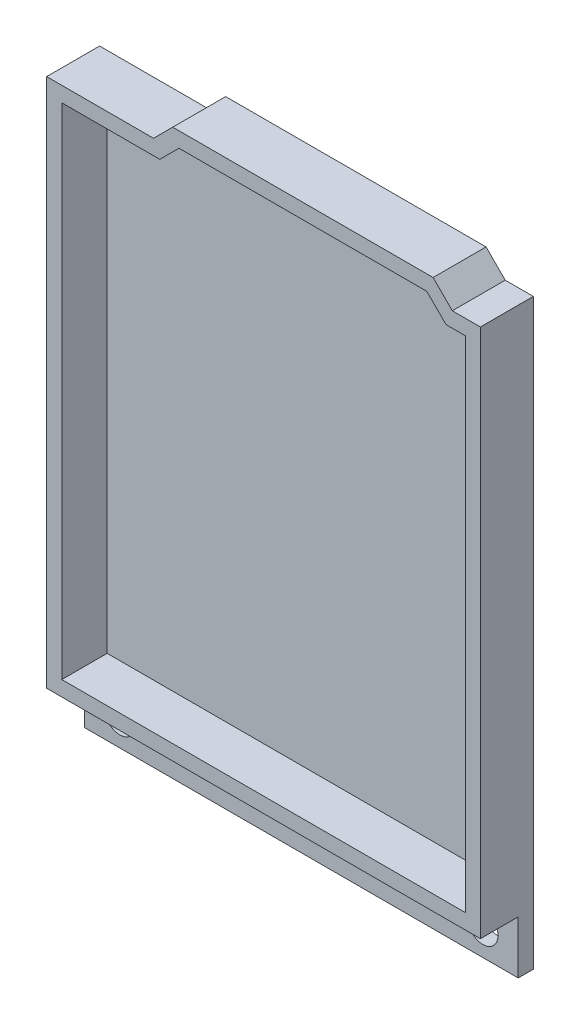
ISO-10303-21;
HEADER;
FILE_DESCRIPTION(('STEP AP214'),'2;1');
FILE_NAME('part.step','',(''),(''),'','','');
FILE_SCHEMA(('AUTOMOTIVE_DESIGN { 1 0 10303 214 1 1 1 1 }'));
ENDSEC;
DATA;
#1=APPLICATION_CONTEXT('core data for automotive mechanical design processes');
#2=APPLICATION_PROTOCOL_DEFINITION('international standard','automotive_design',2000,#1);
#3=PRODUCT_CONTEXT('',#1,'mechanical');
#4=PRODUCT('Part','Part','',(#3));
#5=PRODUCT_RELATED_PRODUCT_CATEGORY('part','',(#4));
#6=PRODUCT_DEFINITION_FORMATION('','',#4);
#7=PRODUCT_DEFINITION_CONTEXT('part definition',#1,'design');
#8=PRODUCT_DEFINITION('design','',#6,#7);
#9=PRODUCT_DEFINITION_SHAPE('','',#8);
#10=(LENGTH_UNIT() NAMED_UNIT(*) SI_UNIT(.MILLI.,.METRE.));
#11=(NAMED_UNIT(*) PLANE_ANGLE_UNIT() SI_UNIT($,.RADIAN.));
#12=(NAMED_UNIT(*) SI_UNIT($,.STERADIAN.) SOLID_ANGLE_UNIT());
#13=UNCERTAINTY_MEASURE_WITH_UNIT(LENGTH_MEASURE(1.E-05),#10,'distance_accuracy_value','');
#14=(GEOMETRIC_REPRESENTATION_CONTEXT(3) GLOBAL_UNCERTAINTY_ASSIGNED_CONTEXT((#13)) GLOBAL_UNIT_ASSIGNED_CONTEXT((#10,
#11,#12)) REPRESENTATION_CONTEXT('',''));
#15=CARTESIAN_POINT('',(0.,0.,0.));
#16=DIRECTION('',(0.,0.,1.));
#17=DIRECTION('',(1.,0.,0.));
#18=AXIS2_PLACEMENT_3D('',#15,#16,#17);
#19=CARTESIAN_POINT('',(2.,-2.,-7.));
#20=DIRECTION('',(0.,-1.,0.));
#21=DIRECTION('',(0.,0.,-1.));
#22=AXIS2_PLACEMENT_3D('',#19,#20,#21);
#23=PLANE('',#22);
#24=DIRECTION('',(0.,0.,1.));
#25=VECTOR('',#24,1.);
#26=CARTESIAN_POINT('',(-55.34,-2.,-7.));
#27=LINE('',#26,#25);
#28=CARTESIAN_POINT('',(-55.34,-2.,-5.));
#29=VERTEX_POINT('',#28);
#30=CARTESIAN_POINT('',(-55.34,-2.,0.));
#31=VERTEX_POINT('',#30);
#32=EDGE_CURVE('E41',#29,#31,#27,.T.);
#33=ORIENTED_EDGE('',*,*,#32,.F.);
#34=DIRECTION('',(1.,0.,0.));
#35=VECTOR('',#34,1.);
#36=CARTESIAN_POINT('',(-55.34,-2.,-5.));
#37=LINE('',#36,#35);
#38=CARTESIAN_POINT('',(2.,-2.,-5.));
#39=VERTEX_POINT('',#38);
#40=EDGE_CURVE('E157',#29,#39,#37,.T.);
#41=ORIENTED_EDGE('',*,*,#40,.T.);
#42=DIRECTION('',(0.,0.,1.));
#43=VECTOR('',#42,1.);
#44=CARTESIAN_POINT('',(2.,-2.,-7.));
#45=LINE('',#44,#43);
#46=CARTESIAN_POINT('',(2.,-2.,0.));
#47=VERTEX_POINT('',#46);
#48=EDGE_CURVE('E11',#39,#47,#45,.T.);
#49=ORIENTED_EDGE('',*,*,#48,.T.);
#50=DIRECTION('',(1.,0.,0.));
#51=VECTOR('',#50,1.);
#52=CARTESIAN_POINT('',(2.,-2.,0.));
#53=LINE('',#52,#51);
#54=EDGE_CURVE('E175',#31,#47,#53,.T.);
#55=ORIENTED_EDGE('',*,*,#54,.F.);
#56=EDGE_LOOP('',(#33,#41,#49,#55));
#57=FACE_BOUND('',#56,.T.);
#58=ADVANCED_FACE('F32',(#57),#23,.T.);
#59=CARTESIAN_POINT('',(2.,68.04,-7.));
#60=DIRECTION('',(1.,0.,0.));
#61=DIRECTION('',(0.,0.,-1.));
#62=AXIS2_PLACEMENT_3D('',#59,#60,#61);
#63=PLANE('',#62);
#64=DIRECTION('',(0.,1.,0.));
#65=VECTOR('',#64,1.);
#66=CARTESIAN_POINT('',(2.,68.04,0.));
#67=LINE('',#66,#65);
#68=CARTESIAN_POINT('',(2.,68.04,0.));
#69=VERTEX_POINT('',#68);
#70=EDGE_CURVE('E210',#47,#69,#67,.T.);
#71=ORIENTED_EDGE('',*,*,#70,.F.);
#72=ORIENTED_EDGE('',*,*,#48,.F.);
#73=DIRECTION('',(0.,-1.,0.));
#74=VECTOR('',#73,1.);
#75=CARTESIAN_POINT('',(2.,-2.00000000000001,-5.));
#76=LINE('',#75,#74);
#77=CARTESIAN_POINT('',(2.,-9.00000000000001,-5.));
#78=VERTEX_POINT('',#77);
#79=EDGE_CURVE('E49',#39,#78,#76,.T.);
#80=ORIENTED_EDGE('',*,*,#79,.T.);
#81=DIRECTION('',(0.,0.,-1.));
#82=VECTOR('',#81,1.);
#83=CARTESIAN_POINT('',(2.,-9.00000000000001,-5.));
#84=LINE('',#83,#82);
#85=CARTESIAN_POINT('',(2.,-9.00000000000001,-7.));
#86=VERTEX_POINT('',#85);
#87=EDGE_CURVE('E264',#78,#86,#84,.T.);
#88=ORIENTED_EDGE('',*,*,#87,.T.);
#89=DIRECTION('',(0.,1.,0.));
#90=VECTOR('',#89,1.);
#91=CARTESIAN_POINT('',(2.,68.04,-7.));
#92=LINE('',#91,#90);
#93=CARTESIAN_POINT('',(2.,68.04,-7.));
#94=VERTEX_POINT('',#93);
#95=EDGE_CURVE('E230',#86,#94,#92,.T.);
#96=ORIENTED_EDGE('',*,*,#95,.T.);
#97=DIRECTION('',(0.,0.,1.));
#98=VECTOR('',#97,1.);
#99=CARTESIAN_POINT('',(2.,68.04,-7.));
#100=LINE('',#99,#98);
#101=EDGE_CURVE('E182',#94,#69,#100,.T.);
#102=ORIENTED_EDGE('',*,*,#101,.T.);
#103=EDGE_LOOP('',(#71,#72,#80,#88,#96,#102));
#104=FACE_BOUND('',#103,.T.);
#105=ADVANCED_FACE('F34',(#104),#63,.T.);
#106=CARTESIAN_POINT('',(-55.34,-2.,-7.));
#107=DIRECTION('',(-1.,0.,0.));
#108=DIRECTION('',(0.,0.,1.));
#109=AXIS2_PLACEMENT_3D('',#106,#107,#108);
#110=PLANE('',#109);
#111=DIRECTION('',(0.,-1.,0.));
#112=VECTOR('',#111,1.);
#113=CARTESIAN_POINT('',(-55.34,-2.,0.));
#114=LINE('',#113,#112);
#115=CARTESIAN_POINT('',(-55.34,68.04,0.));
#116=VERTEX_POINT('',#115);
#117=EDGE_CURVE('E229',#116,#31,#114,.T.);
#118=ORIENTED_EDGE('',*,*,#117,.F.);
#119=DIRECTION('',(0.,0.,1.));
#120=VECTOR('',#119,1.);
#121=CARTESIAN_POINT('',(-55.34,68.04,-7.));
#122=LINE('',#121,#120);
#123=CARTESIAN_POINT('',(-55.34,68.04,-7.));
#124=VERTEX_POINT('',#123);
#125=EDGE_CURVE('E176',#124,#116,#122,.T.);
#126=ORIENTED_EDGE('',*,*,#125,.F.);
#127=DIRECTION('',(0.,-1.,0.));
#128=VECTOR('',#127,1.);
#129=CARTESIAN_POINT('',(-55.34,-2.,-7.));
#130=LINE('',#129,#128);
#131=CARTESIAN_POINT('',(-55.34,-9.,-7.));
#132=VERTEX_POINT('',#131);
#133=EDGE_CURVE('E198',#124,#132,#130,.T.);
#134=ORIENTED_EDGE('',*,*,#133,.T.);
#135=DIRECTION('',(0.,0.,-1.));
#136=VECTOR('',#135,1.);
#137=CARTESIAN_POINT('',(-55.34,-9.,-5.));
#138=LINE('',#137,#136);
#139=CARTESIAN_POINT('',(-55.34,-9.,-5.));
#140=VERTEX_POINT('',#139);
#141=EDGE_CURVE('E171',#140,#132,#138,.T.);
#142=ORIENTED_EDGE('',*,*,#141,.F.);
#143=DIRECTION('',(0.,1.,0.));
#144=VECTOR('',#143,1.);
#145=CARTESIAN_POINT('',(-55.34,-2.,-5.));
#146=LINE('',#145,#144);
#147=EDGE_CURVE('E160',#140,#29,#146,.T.);
#148=ORIENTED_EDGE('',*,*,#147,.T.);
#149=ORIENTED_EDGE('',*,*,#32,.T.);
#150=EDGE_LOOP('',(#118,#126,#134,#142,#148,#149));
#151=FACE_BOUND('',#150,.T.);
#152=ADVANCED_FACE('F168',(#151),#110,.T.);
#153=CARTESIAN_POINT('',(-55.34,68.04,-7.));
#154=DIRECTION('',(0.,1.,0.));
#155=DIRECTION('',(0.,0.,1.));
#156=AXIS2_PLACEMENT_3D('',#153,#154,#155);
#157=PLANE('',#156);
#158=DIRECTION('',(-1.,0.,0.));
#159=VECTOR('',#158,1.);
#160=CARTESIAN_POINT('',(-55.34,68.04,0.));
#161=LINE('',#160,#159);
#162=CARTESIAN_POINT('',(-41.2144271247462,68.04,0.));
#163=VERTEX_POINT('',#162);
#164=EDGE_CURVE('E226',#163,#116,#161,.T.);
#165=ORIENTED_EDGE('',*,*,#164,.F.);
#166=DIRECTION('',(0.,0.,1.));
#167=VECTOR('',#166,1.);
#168=CARTESIAN_POINT('',(-41.2144271247462,68.04,-7.));
#169=LINE('',#168,#167);
#170=CARTESIAN_POINT('',(-41.2144271247462,68.04,-7.));
#171=VERTEX_POINT('',#170);
#172=EDGE_CURVE('E178',#171,#163,#169,.T.);
#173=ORIENTED_EDGE('',*,*,#172,.F.);
#174=DIRECTION('',(-1.,0.,0.));
#175=VECTOR('',#174,1.);
#176=CARTESIAN_POINT('',(-55.34,68.04,-7.));
#177=LINE('',#176,#175);
#178=EDGE_CURVE('E202',#171,#124,#177,.T.);
#179=ORIENTED_EDGE('',*,*,#178,.T.);
#180=ORIENTED_EDGE('',*,*,#125,.T.);
#181=EDGE_LOOP('',(#165,#173,#179,#180));
#182=FACE_BOUND('',#181,.T.);
#183=ADVANCED_FACE('F388',(#182),#157,.T.);
#184=CARTESIAN_POINT('',(-41.2144271247462,68.04,-7.));
#185=DIRECTION('',(-0.707106781186547,0.707106781186547,0.));
#186=DIRECTION('',(-0.707106781186548,-0.707106781186548,0.));
#187=AXIS2_PLACEMENT_3D('',#184,#185,#186);
#188=PLANE('',#187);
#189=DIRECTION('',(-0.707106781186548,-0.707106781186548,0.));
#190=VECTOR('',#189,1.);
#191=CARTESIAN_POINT('',(-41.2144271247462,68.04,0.));
#192=LINE('',#191,#190);
#193=CARTESIAN_POINT('',(-38.6744271247462,70.58,0.));
#194=VERTEX_POINT('',#193);
#195=EDGE_CURVE('E223',#194,#163,#192,.T.);
#196=ORIENTED_EDGE('',*,*,#195,.F.);
#197=DIRECTION('',(0.,0.,1.));
#198=VECTOR('',#197,1.);
#199=CARTESIAN_POINT('',(-38.6744271247462,70.58,-7.));
#200=LINE('',#199,#198);
#201=CARTESIAN_POINT('',(-38.6744271247462,70.58,-7.));
#202=VERTEX_POINT('',#201);
#203=EDGE_CURVE('E190',#202,#194,#200,.T.);
#204=ORIENTED_EDGE('',*,*,#203,.F.);
#205=DIRECTION('',(-0.707106781186548,-0.707106781186548,0.));
#206=VECTOR('',#205,1.);
#207=CARTESIAN_POINT('',(-41.2144271247462,68.04,-7.));
#208=LINE('',#207,#206);
#209=EDGE_CURVE('E206',#202,#171,#208,.T.);
#210=ORIENTED_EDGE('',*,*,#209,.T.);
#211=ORIENTED_EDGE('',*,*,#172,.T.);
#212=EDGE_LOOP('',(#196,#204,#210,#211));
#213=FACE_BOUND('',#212,.T.);
#214=ADVANCED_FACE('F249',(#213),#188,.T.);
#215=CARTESIAN_POINT('',(-38.6744271247462,70.58,-7.));
#216=DIRECTION('',(0.,1.,0.));
#217=DIRECTION('',(0.,0.,1.));
#218=AXIS2_PLACEMENT_3D('',#215,#216,#217);
#219=PLANE('',#218);
#220=DIRECTION('',(-1.,0.,0.));
#221=VECTOR('',#220,1.);
#222=CARTESIAN_POINT('',(-38.6744271247462,70.58,0.));
#223=LINE('',#222,#221);
#224=CARTESIAN_POINT('',(-4.25157287525382,70.58,0.));
#225=VERTEX_POINT('',#224);
#226=EDGE_CURVE('E220',#225,#194,#223,.T.);
#227=ORIENTED_EDGE('',*,*,#226,.F.);
#228=DIRECTION('',(0.,0.,1.));
#229=VECTOR('',#228,1.);
#230=CARTESIAN_POINT('',(-4.25157287525382,70.58,-7.));
#231=LINE('',#230,#229);
#232=CARTESIAN_POINT('',(-4.25157287525382,70.58,-7.));
#233=VERTEX_POINT('',#232);
#234=EDGE_CURVE('E192',#233,#225,#231,.T.);
#235=ORIENTED_EDGE('',*,*,#234,.F.);
#236=DIRECTION('',(-1.,0.,0.));
#237=VECTOR('',#236,1.);
#238=CARTESIAN_POINT('',(-38.6744271247462,70.58,-7.));
#239=LINE('',#238,#237);
#240=EDGE_CURVE('E243',#233,#202,#239,.T.);
#241=ORIENTED_EDGE('',*,*,#240,.T.);
#242=ORIENTED_EDGE('',*,*,#203,.T.);
#243=EDGE_LOOP('',(#227,#235,#241,#242));
#244=FACE_BOUND('',#243,.T.);
#245=ADVANCED_FACE('F258',(#244),#219,.T.);
#246=CARTESIAN_POINT('',(-4.25157287525382,70.58,-7.));
#247=DIRECTION('',(0.707106781186547,0.707106781186547,0.));
#248=DIRECTION('',(-0.707106781186548,0.707106781186548,0.));
#249=AXIS2_PLACEMENT_3D('',#246,#247,#248);
#250=PLANE('',#249);
#251=DIRECTION('',(-0.707106781186548,0.707106781186548,0.));
#252=VECTOR('',#251,1.);
#253=CARTESIAN_POINT('',(-4.25157287525382,70.58,0.));
#254=LINE('',#253,#252);
#255=CARTESIAN_POINT('',(-1.71157287525382,68.04,0.));
#256=VERTEX_POINT('',#255);
#257=EDGE_CURVE('E217',#256,#225,#254,.T.);
#258=ORIENTED_EDGE('',*,*,#257,.F.);
#259=DIRECTION('',(0.,0.,1.));
#260=VECTOR('',#259,1.);
#261=CARTESIAN_POINT('',(-1.71157287525382,68.04,-7.));
#262=LINE('',#261,#260);
#263=CARTESIAN_POINT('',(-1.71157287525382,68.04,-7.));
#264=VERTEX_POINT('',#263);
#265=EDGE_CURVE('E193',#264,#256,#262,.T.);
#266=ORIENTED_EDGE('',*,*,#265,.F.);
#267=DIRECTION('',(-0.707106781186548,0.707106781186548,0.));
#268=VECTOR('',#267,1.);
#269=CARTESIAN_POINT('',(-4.25157287525382,70.58,-7.));
#270=LINE('',#269,#268);
#271=EDGE_CURVE('E235',#264,#233,#270,.T.);
#272=ORIENTED_EDGE('',*,*,#271,.T.);
#273=ORIENTED_EDGE('',*,*,#234,.T.);
#274=EDGE_LOOP('',(#258,#266,#272,#273));
#275=FACE_BOUND('',#274,.T.);
#276=ADVANCED_FACE('F260',(#275),#250,.T.);
#277=CARTESIAN_POINT('',(-1.71157287525382,68.04,-7.));
#278=DIRECTION('',(0.,1.,0.));
#279=DIRECTION('',(0.,0.,1.));
#280=AXIS2_PLACEMENT_3D('',#277,#278,#279);
#281=PLANE('',#280);
#282=DIRECTION('',(-1.,0.,0.));
#283=VECTOR('',#282,1.);
#284=CARTESIAN_POINT('',(-1.71157287525382,68.04,0.));
#285=LINE('',#284,#283);
#286=EDGE_CURVE('E213',#69,#256,#285,.T.);
#287=ORIENTED_EDGE('',*,*,#286,.F.);
#288=ORIENTED_EDGE('',*,*,#101,.F.);
#289=DIRECTION('',(-1.,0.,0.));
#290=VECTOR('',#289,1.);
#291=CARTESIAN_POINT('',(-1.71157287525382,68.04,-7.));
#292=LINE('',#291,#290);
#293=EDGE_CURVE('E232',#94,#264,#292,.T.);
#294=ORIENTED_EDGE('',*,*,#293,.T.);
#295=ORIENTED_EDGE('',*,*,#265,.T.);
#296=EDGE_LOOP('',(#287,#288,#294,#295));
#297=FACE_BOUND('',#296,.T.);
#298=ADVANCED_FACE('F262',(#297),#281,.T.);
#299=CARTESIAN_POINT('',(0.,0.,-7.));
#300=DIRECTION('',(0.,0.,-1.));
#301=DIRECTION('',(-1.,0.,0.));
#302=AXIS2_PLACEMENT_3D('',#299,#300,#301);
#303=PLANE('',#302);
#304=CARTESIAN_POINT('',(-50.67,-5.50000000000001,-7.));
#305=DIRECTION('',(0.,0.,1.));
#306=DIRECTION('',(1.,0.,0.));
#307=AXIS2_PLACEMENT_3D('',#304,#305,#306);
#308=CIRCLE('',#307,2.);
#309=CARTESIAN_POINT('',(-48.67,-5.50000000000001,-7.));
#310=VERTEX_POINT('',#309);
#311=EDGE_CURVE('E576',#310,#310,#308,.T.);
#312=ORIENTED_EDGE('',*,*,#311,.T.);
#313=EDGE_LOOP('',(#312));
#314=FACE_BOUND('',#313,.T.);
#315=CARTESIAN_POINT('',(-2.67,-5.50000000000001,-7.));
#316=DIRECTION('',(0.,0.,1.));
#317=DIRECTION('',(1.,0.,0.));
#318=AXIS2_PLACEMENT_3D('',#315,#316,#317);
#319=CIRCLE('',#318,2.);
#320=CARTESIAN_POINT('',(-0.670000000000002,-5.50000000000001,-7.));
#321=VERTEX_POINT('',#320);
#322=EDGE_CURVE('E277',#321,#321,#319,.T.);
#323=ORIENTED_EDGE('',*,*,#322,.T.);
#324=EDGE_LOOP('',(#323));
#325=FACE_BOUND('',#324,.T.);
#326=ORIENTED_EDGE('',*,*,#95,.F.);
#327=DIRECTION('',(-1.,0.,0.));
#328=VECTOR('',#327,1.);
#329=CARTESIAN_POINT('',(-55.34,-9.,-7.));
#330=LINE('',#329,#328);
#331=EDGE_CURVE('E172',#86,#132,#330,.T.);
#332=ORIENTED_EDGE('',*,*,#331,.T.);
#333=ORIENTED_EDGE('',*,*,#133,.F.);
#334=ORIENTED_EDGE('',*,*,#178,.F.);
#335=ORIENTED_EDGE('',*,*,#209,.F.);
#336=ORIENTED_EDGE('',*,*,#240,.F.);
#337=ORIENTED_EDGE('',*,*,#271,.F.);
#338=ORIENTED_EDGE('',*,*,#293,.F.);
#339=EDGE_LOOP('',(#326,#332,#333,#334,#335,#336,#337,#338));
#340=FACE_BOUND('',#339,.T.);
#341=ADVANCED_FACE('F254',(#314,#325,#340),#303,.T.);
#342=CARTESIAN_POINT('',(0.,0.,0.));
#343=DIRECTION('',(0.,0.,-1.));
#344=DIRECTION('',(-1.,0.,0.));
#345=AXIS2_PLACEMENT_3D('',#342,#343,#344);
#346=PLANE('',#345);
#347=DIRECTION('',(0.,1.,0.));
#348=VECTOR('',#347,1.);
#349=CARTESIAN_POINT('',(0.,66.04,0.));
#350=LINE('',#349,#348);
#351=CARTESIAN_POINT('',(0.,0.,0.));
#352=VERTEX_POINT('',#351);
#353=CARTESIAN_POINT('',(0.,66.04,0.));
#354=VERTEX_POINT('',#353);
#355=EDGE_CURVE('E303',#352,#354,#350,.T.);
#356=ORIENTED_EDGE('',*,*,#355,.F.);
#357=DIRECTION('',(1.,0.,0.));
#358=VECTOR('',#357,1.);
#359=CARTESIAN_POINT('',(0.,0.,0.));
#360=LINE('',#359,#358);
#361=CARTESIAN_POINT('',(-53.34,0.,0.));
#362=VERTEX_POINT('',#361);
#363=EDGE_CURVE('E300',#362,#352,#360,.T.);
#364=ORIENTED_EDGE('',*,*,#363,.F.);
#365=DIRECTION('',(0.,-1.,0.));
#366=VECTOR('',#365,1.);
#367=CARTESIAN_POINT('',(-53.34,0.,0.));
#368=LINE('',#367,#366);
#369=CARTESIAN_POINT('',(-53.34,66.04,0.));
#370=VERTEX_POINT('',#369);
#371=EDGE_CURVE('E321',#370,#362,#368,.T.);
#372=ORIENTED_EDGE('',*,*,#371,.F.);
#373=DIRECTION('',(-1.,0.,0.));
#374=VECTOR('',#373,1.);
#375=CARTESIAN_POINT('',(-53.34,66.04,0.));
#376=LINE('',#375,#374);
#377=CARTESIAN_POINT('',(-40.386,66.04,0.));
#378=VERTEX_POINT('',#377);
#379=EDGE_CURVE('E318',#378,#370,#376,.T.);
#380=ORIENTED_EDGE('',*,*,#379,.F.);
#381=DIRECTION('',(-0.707106781186548,-0.707106781186548,0.));
#382=VECTOR('',#381,1.);
#383=CARTESIAN_POINT('',(-40.386,66.04,0.));
#384=LINE('',#383,#382);
#385=CARTESIAN_POINT('',(-37.846,68.58,0.));
#386=VERTEX_POINT('',#385);
#387=EDGE_CURVE('E315',#386,#378,#384,.T.);
#388=ORIENTED_EDGE('',*,*,#387,.F.);
#389=DIRECTION('',(-1.,0.,0.));
#390=VECTOR('',#389,1.);
#391=CARTESIAN_POINT('',(-37.846,68.58,0.));
#392=LINE('',#391,#390);
#393=CARTESIAN_POINT('',(-5.08,68.58,0.));
#394=VERTEX_POINT('',#393);
#395=EDGE_CURVE('E312',#394,#386,#392,.T.);
#396=ORIENTED_EDGE('',*,*,#395,.F.);
#397=DIRECTION('',(-0.707106781186547,0.707106781186548,0.));
#398=VECTOR('',#397,1.);
#399=CARTESIAN_POINT('',(-5.08,68.58,0.));
#400=LINE('',#399,#398);
#401=CARTESIAN_POINT('',(-2.54,66.04,0.));
#402=VERTEX_POINT('',#401);
#403=EDGE_CURVE('E309',#402,#394,#400,.T.);
#404=ORIENTED_EDGE('',*,*,#403,.F.);
#405=DIRECTION('',(-1.,0.,0.));
#406=VECTOR('',#405,1.);
#407=CARTESIAN_POINT('',(-2.54,66.04,0.));
#408=LINE('',#407,#406);
#409=EDGE_CURVE('E306',#354,#402,#408,.T.);
#410=ORIENTED_EDGE('',*,*,#409,.F.);
#411=EDGE_LOOP('',(#356,#364,#372,#380,#388,#396,#404,#410));
#412=FACE_BOUND('',#411,.T.);
#413=ORIENTED_EDGE('',*,*,#70,.T.);
#414=ORIENTED_EDGE('',*,*,#286,.T.);
#415=ORIENTED_EDGE('',*,*,#257,.T.);
#416=ORIENTED_EDGE('',*,*,#226,.T.);
#417=ORIENTED_EDGE('',*,*,#195,.T.);
#418=ORIENTED_EDGE('',*,*,#164,.T.);
#419=ORIENTED_EDGE('',*,*,#117,.T.);
#420=ORIENTED_EDGE('',*,*,#54,.T.);
#421=EDGE_LOOP('',(#413,#414,#415,#416,#417,#418,#419,#420));
#422=FACE_BOUND('',#421,.T.);
#423=ADVANCED_FACE('F263',(#412,#422),#346,.F.);
#424=CARTESIAN_POINT('',(0.,0.,-7.));
#425=DIRECTION('',(0.,-1.,0.));
#426=DIRECTION('',(1.,0.,0.));
#427=AXIS2_PLACEMENT_3D('',#424,#425,#426);
#428=PLANE('',#427);
#429=DIRECTION('',(0.,0.,1.));
#430=VECTOR('',#429,1.);
#431=CARTESIAN_POINT('',(0.,0.,-7.));
#432=LINE('',#431,#430);
#433=CARTESIAN_POINT('',(0.,0.,-6.));
#434=VERTEX_POINT('',#433);
#435=EDGE_CURVE('E238',#434,#352,#432,.T.);
#436=ORIENTED_EDGE('',*,*,#435,.F.);
#437=DIRECTION('',(-1.,0.,0.));
#438=VECTOR('',#437,1.);
#439=CARTESIAN_POINT('',(-53.34,0.,-6.));
#440=LINE('',#439,#438);
#441=CARTESIAN_POINT('',(-53.34,0.,-6.));
#442=VERTEX_POINT('',#441);
#443=EDGE_CURVE('E57',#434,#442,#440,.T.);
#444=ORIENTED_EDGE('',*,*,#443,.T.);
#445=DIRECTION('',(0.,0.,1.));
#446=VECTOR('',#445,1.);
#447=CARTESIAN_POINT('',(-53.34,0.,-7.));
#448=LINE('',#447,#446);
#449=EDGE_CURVE('E214',#442,#362,#448,.T.);
#450=ORIENTED_EDGE('',*,*,#449,.T.);
#451=ORIENTED_EDGE('',*,*,#363,.T.);
#452=EDGE_LOOP('',(#436,#444,#450,#451));
#453=FACE_BOUND('',#452,.T.);
#454=ADVANCED_FACE('F344',(#453),#428,.F.);
#455=CARTESIAN_POINT('',(-53.34,0.,-7.));
#456=DIRECTION('',(-1.,0.,0.));
#457=DIRECTION('',(0.,0.,1.));
#458=AXIS2_PLACEMENT_3D('',#455,#456,#457);
#459=PLANE('',#458);
#460=ORIENTED_EDGE('',*,*,#449,.F.);
#461=DIRECTION('',(0.,1.,0.));
#462=VECTOR('',#461,1.);
#463=CARTESIAN_POINT('',(-53.34,66.04,-6.));
#464=LINE('',#463,#462);
#465=CARTESIAN_POINT('',(-53.34,66.04,-6.));
#466=VERTEX_POINT('',#465);
#467=EDGE_CURVE('E278',#442,#466,#464,.T.);
#468=ORIENTED_EDGE('',*,*,#467,.T.);
#469=DIRECTION('',(0.,0.,1.));
#470=VECTOR('',#469,1.);
#471=CARTESIAN_POINT('',(-53.34,66.04,-7.));
#472=LINE('',#471,#470);
#473=EDGE_CURVE('E325',#466,#370,#472,.T.);
#474=ORIENTED_EDGE('',*,*,#473,.T.);
#475=ORIENTED_EDGE('',*,*,#371,.T.);
#476=EDGE_LOOP('',(#460,#468,#474,#475));
#477=FACE_BOUND('',#476,.T.);
#478=ADVANCED_FACE('F368',(#477),#459,.F.);
#479=CARTESIAN_POINT('',(-53.34,66.04,-7.));
#480=DIRECTION('',(0.,1.,0.));
#481=DIRECTION('',(0.,0.,1.));
#482=AXIS2_PLACEMENT_3D('',#479,#480,#481);
#483=PLANE('',#482);
#484=ORIENTED_EDGE('',*,*,#473,.F.);
#485=DIRECTION('',(1.,0.,0.));
#486=VECTOR('',#485,1.);
#487=CARTESIAN_POINT('',(-40.386,66.04,-6.));
#488=LINE('',#487,#486);
#489=CARTESIAN_POINT('',(-40.386,66.04,-6.));
#490=VERTEX_POINT('',#489);
#491=EDGE_CURVE('E282',#466,#490,#488,.T.);
#492=ORIENTED_EDGE('',*,*,#491,.T.);
#493=DIRECTION('',(0.,0.,1.));
#494=VECTOR('',#493,1.);
#495=CARTESIAN_POINT('',(-40.386,66.04,-7.));
#496=LINE('',#495,#494);
#497=EDGE_CURVE('E327',#490,#378,#496,.T.);
#498=ORIENTED_EDGE('',*,*,#497,.T.);
#499=ORIENTED_EDGE('',*,*,#379,.T.);
#500=EDGE_LOOP('',(#484,#492,#498,#499));
#501=FACE_BOUND('',#500,.T.);
#502=ADVANCED_FACE('F366',(#501),#483,.F.);
#503=CARTESIAN_POINT('',(-40.386,66.04,-7.));
#504=DIRECTION('',(-0.707106781186547,0.707106781186547,0.));
#505=DIRECTION('',(-0.707106781186548,-0.707106781186548,0.));
#506=AXIS2_PLACEMENT_3D('',#503,#504,#505);
#507=PLANE('',#506);
#508=ORIENTED_EDGE('',*,*,#497,.F.);
#509=DIRECTION('',(0.707106781186548,0.707106781186548,0.));
#510=VECTOR('',#509,1.);
#511=CARTESIAN_POINT('',(-37.846,68.58,-6.));
#512=LINE('',#511,#510);
#513=CARTESIAN_POINT('',(-37.846,68.58,-6.));
#514=VERTEX_POINT('',#513);
#515=EDGE_CURVE('E285',#490,#514,#512,.T.);
#516=ORIENTED_EDGE('',*,*,#515,.T.);
#517=DIRECTION('',(0.,0.,1.));
#518=VECTOR('',#517,1.);
#519=CARTESIAN_POINT('',(-37.846,68.58,-7.));
#520=LINE('',#519,#518);
#521=EDGE_CURVE('E329',#514,#386,#520,.T.);
#522=ORIENTED_EDGE('',*,*,#521,.T.);
#523=ORIENTED_EDGE('',*,*,#387,.T.);
#524=EDGE_LOOP('',(#508,#516,#522,#523));
#525=FACE_BOUND('',#524,.T.);
#526=ADVANCED_FACE('F362',(#525),#507,.F.);
#527=CARTESIAN_POINT('',(-37.846,68.58,-7.));
#528=DIRECTION('',(0.,1.,0.));
#529=DIRECTION('',(0.,0.,1.));
#530=AXIS2_PLACEMENT_3D('',#527,#528,#529);
#531=PLANE('',#530);
#532=ORIENTED_EDGE('',*,*,#521,.F.);
#533=DIRECTION('',(1.,0.,0.));
#534=VECTOR('',#533,1.);
#535=CARTESIAN_POINT('',(-5.08,68.58,-6.));
#536=LINE('',#535,#534);
#537=CARTESIAN_POINT('',(-5.08,68.58,-6.));
#538=VERTEX_POINT('',#537);
#539=EDGE_CURVE('E288',#514,#538,#536,.T.);
#540=ORIENTED_EDGE('',*,*,#539,.T.);
#541=DIRECTION('',(0.,0.,1.));
#542=VECTOR('',#541,1.);
#543=CARTESIAN_POINT('',(-5.08,68.58,-7.));
#544=LINE('',#543,#542);
#545=EDGE_CURVE('E331',#538,#394,#544,.T.);
#546=ORIENTED_EDGE('',*,*,#545,.T.);
#547=ORIENTED_EDGE('',*,*,#395,.T.);
#548=EDGE_LOOP('',(#532,#540,#546,#547));
#549=FACE_BOUND('',#548,.T.);
#550=ADVANCED_FACE('F358',(#549),#531,.F.);
#551=CARTESIAN_POINT('',(-5.08,68.58,-7.));
#552=DIRECTION('',(0.707106781186548,0.707106781186547,0.));
#553=DIRECTION('',(-0.707106781186547,0.707106781186548,0.));
#554=AXIS2_PLACEMENT_3D('',#551,#552,#553);
#555=PLANE('',#554);
#556=ORIENTED_EDGE('',*,*,#545,.F.);
#557=DIRECTION('',(0.707106781186547,-0.707106781186548,0.));
#558=VECTOR('',#557,1.);
#559=CARTESIAN_POINT('',(-2.54,66.04,-6.));
#560=LINE('',#559,#558);
#561=CARTESIAN_POINT('',(-2.54,66.04,-6.));
#562=VERTEX_POINT('',#561);
#563=EDGE_CURVE('E291',#538,#562,#560,.T.);
#564=ORIENTED_EDGE('',*,*,#563,.T.);
#565=DIRECTION('',(0.,0.,1.));
#566=VECTOR('',#565,1.);
#567=CARTESIAN_POINT('',(-2.54,66.04,-7.));
#568=LINE('',#567,#566);
#569=EDGE_CURVE('E333',#562,#402,#568,.T.);
#570=ORIENTED_EDGE('',*,*,#569,.T.);
#571=ORIENTED_EDGE('',*,*,#403,.T.);
#572=EDGE_LOOP('',(#556,#564,#570,#571));
#573=FACE_BOUND('',#572,.T.);
#574=ADVANCED_FACE('F354',(#573),#555,.F.);
#575=CARTESIAN_POINT('',(-2.54,66.04,-7.));
#576=DIRECTION('',(0.,1.,0.));
#577=DIRECTION('',(0.,0.,1.));
#578=AXIS2_PLACEMENT_3D('',#575,#576,#577);
#579=PLANE('',#578);
#580=ORIENTED_EDGE('',*,*,#569,.F.);
#581=DIRECTION('',(1.,0.,0.));
#582=VECTOR('',#581,1.);
#583=CARTESIAN_POINT('',(0.,66.04,-6.));
#584=LINE('',#583,#582);
#585=CARTESIAN_POINT('',(0.,66.04,-6.));
#586=VERTEX_POINT('',#585);
#587=EDGE_CURVE('E294',#562,#586,#584,.T.);
#588=ORIENTED_EDGE('',*,*,#587,.T.);
#589=DIRECTION('',(0.,0.,1.));
#590=VECTOR('',#589,1.);
#591=CARTESIAN_POINT('',(0.,66.04,-7.));
#592=LINE('',#591,#590);
#593=EDGE_CURVE('E334',#586,#354,#592,.T.);
#594=ORIENTED_EDGE('',*,*,#593,.T.);
#595=ORIENTED_EDGE('',*,*,#409,.T.);
#596=EDGE_LOOP('',(#580,#588,#594,#595));
#597=FACE_BOUND('',#596,.T.);
#598=ADVANCED_FACE('F351',(#597),#579,.F.);
#599=CARTESIAN_POINT('',(0.,66.04,-7.));
#600=DIRECTION('',(1.,0.,0.));
#601=DIRECTION('',(0.,0.,-1.));
#602=AXIS2_PLACEMENT_3D('',#599,#600,#601);
#603=PLANE('',#602);
#604=ORIENTED_EDGE('',*,*,#593,.F.);
#605=DIRECTION('',(0.,-1.,0.));
#606=VECTOR('',#605,1.);
#607=CARTESIAN_POINT('',(0.,0.,-6.));
#608=LINE('',#607,#606);
#609=EDGE_CURVE('E297',#586,#434,#608,.T.);
#610=ORIENTED_EDGE('',*,*,#609,.T.);
#611=ORIENTED_EDGE('',*,*,#435,.T.);
#612=ORIENTED_EDGE('',*,*,#355,.T.);
#613=EDGE_LOOP('',(#604,#610,#611,#612));
#614=FACE_BOUND('',#613,.T.);
#615=ADVANCED_FACE('F339',(#614),#603,.F.);
#616=CARTESIAN_POINT('',(0.,0.,-6.));
#617=DIRECTION('',(0.,0.,1.));
#618=DIRECTION('',(1.,0.,0.));
#619=AXIS2_PLACEMENT_3D('',#616,#617,#618);
#620=PLANE('',#619);
#621=ORIENTED_EDGE('',*,*,#467,.F.);
#622=ORIENTED_EDGE('',*,*,#443,.F.);
#623=ORIENTED_EDGE('',*,*,#609,.F.);
#624=ORIENTED_EDGE('',*,*,#587,.F.);
#625=ORIENTED_EDGE('',*,*,#563,.F.);
#626=ORIENTED_EDGE('',*,*,#539,.F.);
#627=ORIENTED_EDGE('',*,*,#515,.F.);
#628=ORIENTED_EDGE('',*,*,#491,.F.);
#629=EDGE_LOOP('',(#621,#622,#623,#624,#625,#626,#627,#628));
#630=FACE_BOUND('',#629,.T.);
#631=ADVANCED_FACE('F355',(#630),#620,.T.);
#632=CARTESIAN_POINT('',(-55.34,-9.,-5.));
#633=DIRECTION('',(0.,-1.,0.));
#634=DIRECTION('',(1.,0.,0.));
#635=AXIS2_PLACEMENT_3D('',#632,#633,#634);
#636=PLANE('',#635);
#637=ORIENTED_EDGE('',*,*,#331,.F.);
#638=ORIENTED_EDGE('',*,*,#87,.F.);
#639=DIRECTION('',(-1.,0.,0.));
#640=VECTOR('',#639,1.);
#641=CARTESIAN_POINT('',(-55.34,-9.,-5.));
#642=LINE('',#641,#640);
#643=EDGE_CURVE('E266',#78,#140,#642,.T.);
#644=ORIENTED_EDGE('',*,*,#643,.T.);
#645=ORIENTED_EDGE('',*,*,#141,.T.);
#646=EDGE_LOOP('',(#637,#638,#644,#645));
#647=FACE_BOUND('',#646,.T.);
#648=ADVANCED_FACE('F443',(#647),#636,.T.);
#649=CARTESIAN_POINT('',(0.,0.,-5.));
#650=DIRECTION('',(0.,0.,1.));
#651=DIRECTION('',(1.,0.,0.));
#652=AXIS2_PLACEMENT_3D('',#649,#650,#651);
#653=PLANE('',#652);
#654=CARTESIAN_POINT('',(-50.67,-5.50000000000001,-5.));
#655=DIRECTION('',(0.,0.,1.));
#656=DIRECTION('',(1.,0.,0.));
#657=AXIS2_PLACEMENT_3D('',#654,#655,#656);
#658=CIRCLE('',#657,2.);
#659=CARTESIAN_POINT('',(-48.67,-5.50000000000001,-5.));
#660=VERTEX_POINT('',#659);
#661=EDGE_CURVE('E579',#660,#660,#658,.T.);
#662=ORIENTED_EDGE('',*,*,#661,.F.);
#663=EDGE_LOOP('',(#662));
#664=FACE_BOUND('',#663,.T.);
#665=CARTESIAN_POINT('',(-2.67,-5.50000000000001,-5.));
#666=DIRECTION('',(0.,0.,1.));
#667=DIRECTION('',(1.,0.,0.));
#668=AXIS2_PLACEMENT_3D('',#665,#666,#667);
#669=CIRCLE('',#668,2.);
#670=CARTESIAN_POINT('',(-0.670000000000002,-5.50000000000001,-5.));
#671=VERTEX_POINT('',#670);
#672=EDGE_CURVE('E581',#671,#671,#669,.T.);
#673=ORIENTED_EDGE('',*,*,#672,.F.);
#674=EDGE_LOOP('',(#673));
#675=FACE_BOUND('',#674,.T.);
#676=ORIENTED_EDGE('',*,*,#147,.F.);
#677=ORIENTED_EDGE('',*,*,#643,.F.);
#678=ORIENTED_EDGE('',*,*,#79,.F.);
#679=ORIENTED_EDGE('',*,*,#40,.F.);
#680=EDGE_LOOP('',(#676,#677,#678,#679));
#681=FACE_BOUND('',#680,.T.);
#682=ADVANCED_FACE('F159',(#664,#675,#681),#653,.T.);
#683=CARTESIAN_POINT('',(-2.67,-5.50000000000001,-7.));
#684=DIRECTION('',(0.,0.,1.));
#685=DIRECTION('',(1.,0.,0.));
#686=AXIS2_PLACEMENT_3D('',#683,#684,#685);
#687=CYLINDRICAL_SURFACE('',#686,2.);
#688=ORIENTED_EDGE('',*,*,#322,.F.);
#689=EDGE_LOOP('',(#688));
#690=FACE_BOUND('',#689,.T.);
#691=ORIENTED_EDGE('',*,*,#672,.T.);
#692=EDGE_LOOP('',(#691));
#693=FACE_BOUND('',#692,.T.);
#694=ADVANCED_FACE('F456',(#690,#693),#687,.F.);
#695=CARTESIAN_POINT('',(-50.67,-5.50000000000001,-7.));
#696=DIRECTION('',(0.,0.,1.));
#697=DIRECTION('',(1.,0.,0.));
#698=AXIS2_PLACEMENT_3D('',#695,#696,#697);
#699=CYLINDRICAL_SURFACE('',#698,2.);
#700=ORIENTED_EDGE('',*,*,#311,.F.);
#701=EDGE_LOOP('',(#700));
#702=FACE_BOUND('',#701,.T.);
#703=ORIENTED_EDGE('',*,*,#661,.T.);
#704=EDGE_LOOP('',(#703));
#705=FACE_BOUND('',#704,.T.);
#706=ADVANCED_FACE('F464',(#702,#705),#699,.F.);
#707=CLOSED_SHELL('',(#58,#105,#152,#183,#214,#245,#276,#298,#341,#423,#454,#478,#502,#526,#550,
#574,#598,#615,#631,#648,#682,#694,#706));
#708=MANIFOLD_SOLID_BREP('B2',#707);
#709=ADVANCED_BREP_SHAPE_REPRESENTATION('',(#18,#708),#14);
#710=SHAPE_DEFINITION_REPRESENTATION(#9,#709);
ENDSEC;
END-ISO-10303-21;
